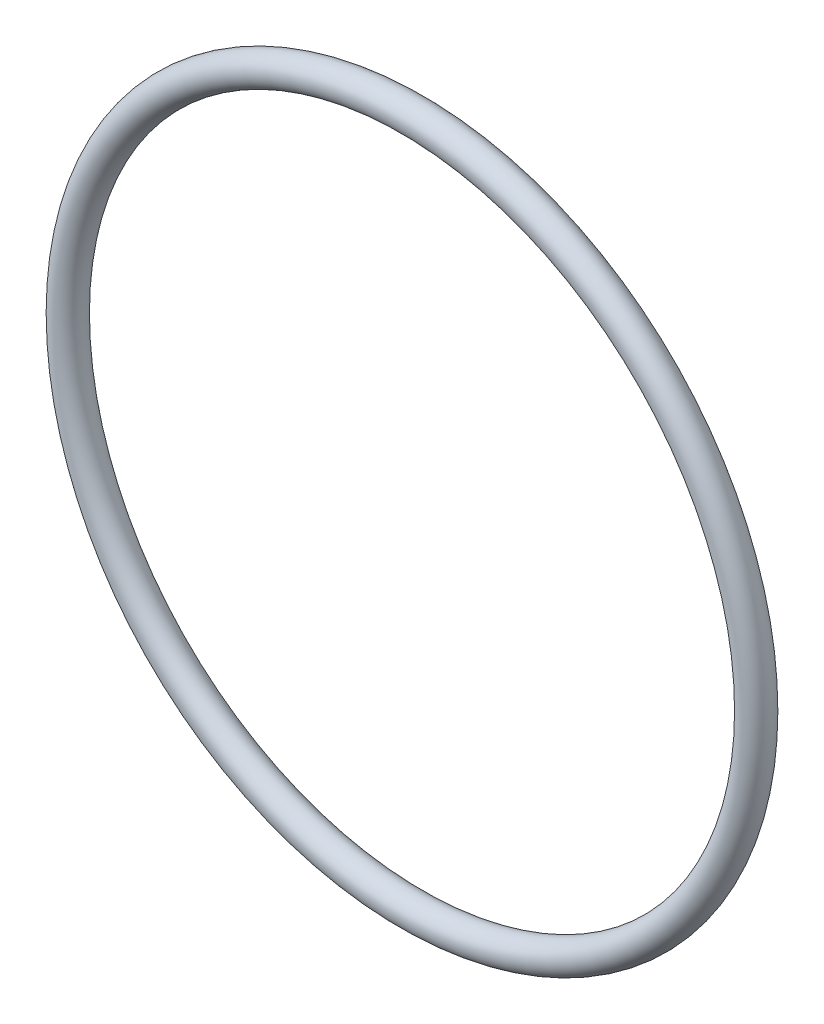
ISO-10303-21;
HEADER;
FILE_DESCRIPTION(('STEP AP214'),'2;1');
FILE_NAME('part.step','',(''),(''),'','','');
FILE_SCHEMA(('AUTOMOTIVE_DESIGN { 1 0 10303 214 1 1 1 1 }'));
ENDSEC;
DATA;
#1=APPLICATION_CONTEXT('core data for automotive mechanical design processes');
#2=APPLICATION_PROTOCOL_DEFINITION('international standard','automotive_design',2000,#1);
#3=PRODUCT_CONTEXT('',#1,'mechanical');
#4=PRODUCT('Part','Part','',(#3));
#5=PRODUCT_RELATED_PRODUCT_CATEGORY('part','',(#4));
#6=PRODUCT_DEFINITION_FORMATION('','',#4);
#7=PRODUCT_DEFINITION_CONTEXT('part definition',#1,'design');
#8=PRODUCT_DEFINITION('design','',#6,#7);
#9=PRODUCT_DEFINITION_SHAPE('','',#8);
#10=(LENGTH_UNIT() NAMED_UNIT(*) SI_UNIT(.MILLI.,.METRE.));
#11=(NAMED_UNIT(*) PLANE_ANGLE_UNIT() SI_UNIT($,.RADIAN.));
#12=(NAMED_UNIT(*) SI_UNIT($,.STERADIAN.) SOLID_ANGLE_UNIT());
#13=UNCERTAINTY_MEASURE_WITH_UNIT(LENGTH_MEASURE(1.E-05),#10,'distance_accuracy_value','');
#14=(GEOMETRIC_REPRESENTATION_CONTEXT(3) GLOBAL_UNCERTAINTY_ASSIGNED_CONTEXT((#13)) GLOBAL_UNIT_ASSIGNED_CONTEXT((#10,
#11,#12)) REPRESENTATION_CONTEXT('',''));
#15=CARTESIAN_POINT('',(0.,0.,0.));
#16=DIRECTION('',(0.,0.,1.));
#17=DIRECTION('',(1.,0.,0.));
#18=AXIS2_PLACEMENT_3D('',#15,#16,#17);
#19=CARTESIAN_POINT('',(0.,0.,0.));
#20=DIRECTION('',(0.,0.,1.));
#21=DIRECTION('',(1.,0.,0.));
#22=AXIS2_PLACEMENT_3D('',#19,#20,#21);
#23=TOROIDAL_SURFACE('',#22,39.6621,1.76530000000001);
#24=CARTESIAN_POINT('',(41.4274,0.,0.));
#25=VERTEX_POINT('',#24);
#26=VERTEX_LOOP('',#25);
#27=FACE_BOUND('',#26,.T.);
#28=ADVANCED_FACE('F28',(#27),#23,.T.);
#29=CLOSED_SHELL('',(#28));
#30=MANIFOLD_SOLID_BREP('B2',#29);
#31=ADVANCED_BREP_SHAPE_REPRESENTATION('',(#18,#30),#14);
#32=SHAPE_DEFINITION_REPRESENTATION(#9,#31);
ENDSEC;
END-ISO-10303-21;
